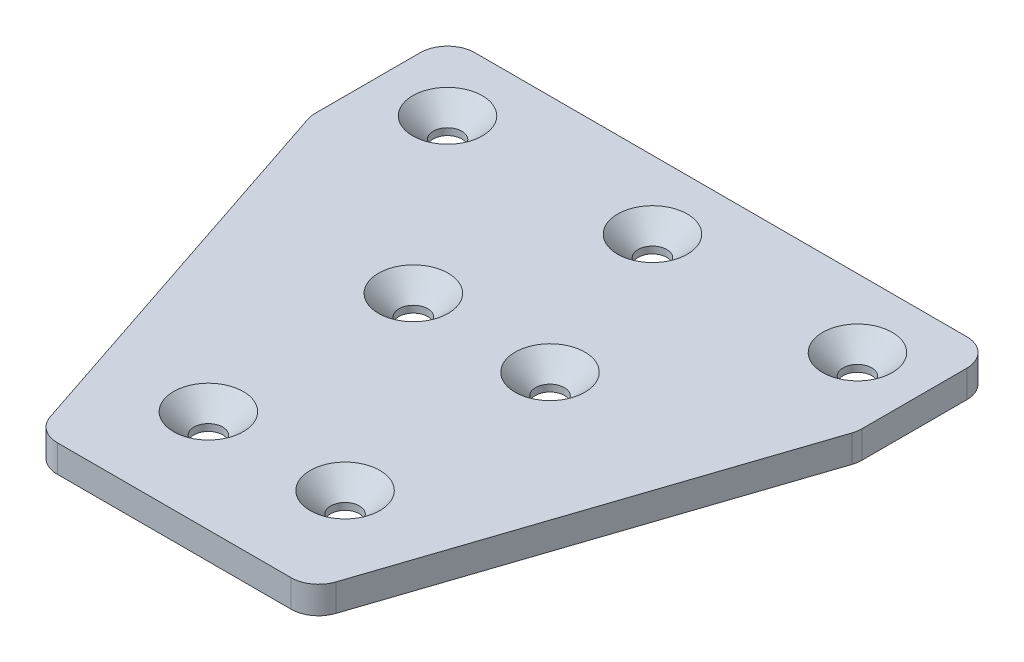
ISO-10303-21;
HEADER;
FILE_DESCRIPTION(('STEP AP214'),'2;1');
FILE_NAME('part.step','',(''),(''),'','','');
FILE_SCHEMA(('AUTOMOTIVE_DESIGN { 1 0 10303 214 1 1 1 1 }'));
ENDSEC;
DATA;
#1=APPLICATION_CONTEXT('core data for automotive mechanical design processes');
#2=APPLICATION_PROTOCOL_DEFINITION('international standard','automotive_design',2000,#1);
#3=PRODUCT_CONTEXT('',#1,'mechanical');
#4=PRODUCT('Part','Part','',(#3));
#5=PRODUCT_RELATED_PRODUCT_CATEGORY('part','',(#4));
#6=PRODUCT_DEFINITION_FORMATION('','',#4);
#7=PRODUCT_DEFINITION_CONTEXT('part definition',#1,'design');
#8=PRODUCT_DEFINITION('design','',#6,#7);
#9=PRODUCT_DEFINITION_SHAPE('','',#8);
#10=(LENGTH_UNIT() NAMED_UNIT(*) SI_UNIT(.MILLI.,.METRE.));
#11=(NAMED_UNIT(*) PLANE_ANGLE_UNIT() SI_UNIT($,.RADIAN.));
#12=(NAMED_UNIT(*) SI_UNIT($,.STERADIAN.) SOLID_ANGLE_UNIT());
#13=UNCERTAINTY_MEASURE_WITH_UNIT(LENGTH_MEASURE(1.E-05),#10,'distance_accuracy_value','');
#14=(GEOMETRIC_REPRESENTATION_CONTEXT(3) GLOBAL_UNCERTAINTY_ASSIGNED_CONTEXT((#13)) GLOBAL_UNIT_ASSIGNED_CONTEXT((#10,
#11,#12)) REPRESENTATION_CONTEXT('',''));
#15=CARTESIAN_POINT('',(0.,0.,0.));
#16=DIRECTION('',(0.,0.,1.));
#17=DIRECTION('',(1.,0.,0.));
#18=AXIS2_PLACEMENT_3D('',#15,#16,#17);
#19=CARTESIAN_POINT('',(39.,4.,13.));
#20=DIRECTION('',(-0.948683298050514,0.,-0.316227766016838));
#21=DIRECTION('',(-0.316227766016838,0.,0.948683298050514));
#22=AXIS2_PLACEMENT_3D('',#19,#20,#21);
#23=PLANE('',#22);
#24=DIRECTION('',(0.316227766016838,0.,-0.948683298050514));
#25=VECTOR('',#24,1.);
#26=CARTESIAN_POINT('',(39.,0.,13.));
#27=LINE('',#26,#25);
#28=CARTESIAN_POINT('',(20.9116963119776,0.,67.2649110640673));
#29=VERTEX_POINT('',#28);
#30=CARTESIAN_POINT('',(39.7947331922021,0.,10.6158004233938));
#31=VERTEX_POINT('',#30);
#32=EDGE_CURVE('E327',#29,#31,#27,.T.);
#33=ORIENTED_EDGE('',*,*,#32,.T.);
#34=DIRECTION('',(0.,-1.,0.));
#35=VECTOR('',#34,1.);
#36=CARTESIAN_POINT('',(39.7947331922021,4.,10.6158004233938));
#37=LINE('',#36,#35);
#38=CARTESIAN_POINT('',(39.7947331922021,4.,10.6158004233938));
#39=VERTEX_POINT('',#38);
#40=EDGE_CURVE('E318',#31,#39,#37,.F.);
#41=ORIENTED_EDGE('',*,*,#40,.T.);
#42=DIRECTION('',(0.316227766016838,0.,-0.948683298050514));
#43=VECTOR('',#42,1.);
#44=CARTESIAN_POINT('',(39.,4.,13.));
#45=LINE('',#44,#43);
#46=CARTESIAN_POINT('',(20.9116963119776,4.,67.2649110640673));
#47=VERTEX_POINT('',#46);
#48=EDGE_CURVE('E205',#47,#39,#45,.T.);
#49=ORIENTED_EDGE('',*,*,#48,.F.);
#50=DIRECTION('',(0.,-1.,0.));
#51=VECTOR('',#50,1.);
#52=CARTESIAN_POINT('',(20.9116963119776,4.,67.2649110640673));
#53=LINE('',#52,#51);
#54=EDGE_CURVE('E314',#47,#29,#53,.T.);
#55=ORIENTED_EDGE('',*,*,#54,.T.);
#56=EDGE_LOOP('',(#33,#41,#49,#55));
#57=FACE_BOUND('',#56,.T.);
#58=ADVANCED_FACE('F48',(#57),#23,.F.);
#59=CARTESIAN_POINT('',(40.,4.,0.));
#60=DIRECTION('',(-1.,0.,0.));
#61=DIRECTION('',(0.,0.,1.));
#62=AXIS2_PLACEMENT_3D('',#59,#60,#61);
#63=PLANE('',#62);
#64=DIRECTION('',(0.,0.,-1.));
#65=VECTOR('',#64,1.);
#66=CARTESIAN_POINT('',(40.,0.,0.));
#67=LINE('',#66,#65);
#68=CARTESIAN_POINT('',(40.,0.,9.35088935932646));
#69=VERTEX_POINT('',#68);
#70=CARTESIAN_POINT('',(40.,0.,-6.));
#71=VERTEX_POINT('',#70);
#72=EDGE_CURVE('E358',#69,#71,#67,.T.);
#73=ORIENTED_EDGE('',*,*,#72,.T.);
#74=DIRECTION('',(0.,-1.,0.));
#75=VECTOR('',#74,1.);
#76=CARTESIAN_POINT('',(40.,4.,-6.));
#77=LINE('',#76,#75);
#78=CARTESIAN_POINT('',(40.,4.,-6.));
#79=VERTEX_POINT('',#78);
#80=EDGE_CURVE('E311',#71,#79,#77,.F.);
#81=ORIENTED_EDGE('',*,*,#80,.T.);
#82=DIRECTION('',(0.,0.,-1.));
#83=VECTOR('',#82,1.);
#84=CARTESIAN_POINT('',(40.,4.,0.));
#85=LINE('',#84,#83);
#86=CARTESIAN_POINT('',(40.,4.,9.35088935932646));
#87=VERTEX_POINT('',#86);
#88=EDGE_CURVE('E338',#87,#79,#85,.T.);
#89=ORIENTED_EDGE('',*,*,#88,.F.);
#90=DIRECTION('',(0.,-1.,0.));
#91=VECTOR('',#90,1.);
#92=CARTESIAN_POINT('',(40.,4.,9.35088935932646));
#93=LINE('',#92,#91);
#94=EDGE_CURVE('E307',#87,#69,#93,.T.);
#95=ORIENTED_EDGE('',*,*,#94,.T.);
#96=EDGE_LOOP('',(#73,#81,#89,#95));
#97=FACE_BOUND('',#96,.T.);
#98=ADVANCED_FACE('F386',(#97),#63,.F.);
#99=CARTESIAN_POINT('',(0.,4.,-10.));
#100=DIRECTION('',(0.,0.,-1.));
#101=DIRECTION('',(-1.,0.,0.));
#102=AXIS2_PLACEMENT_3D('',#99,#100,#101);
#103=PLANE('',#102);
#104=DIRECTION('',(1.,0.,0.));
#105=VECTOR('',#104,1.);
#106=CARTESIAN_POINT('',(0.,0.,-10.));
#107=LINE('',#106,#105);
#108=CARTESIAN_POINT('',(-36.,0.,-10.));
#109=VERTEX_POINT('',#108);
#110=CARTESIAN_POINT('',(36.,0.,-10.));
#111=VERTEX_POINT('',#110);
#112=EDGE_CURVE('E174',#109,#111,#107,.T.);
#113=ORIENTED_EDGE('',*,*,#112,.F.);
#114=DIRECTION('',(0.,-1.,0.));
#115=VECTOR('',#114,1.);
#116=CARTESIAN_POINT('',(-36.,4.,-10.));
#117=LINE('',#116,#115);
#118=CARTESIAN_POINT('',(-36.,4.,-10.));
#119=VERTEX_POINT('',#118);
#120=EDGE_CURVE('E304',#109,#119,#117,.F.);
#121=ORIENTED_EDGE('',*,*,#120,.T.);
#122=DIRECTION('',(1.,0.,0.));
#123=VECTOR('',#122,1.);
#124=CARTESIAN_POINT('',(0.,4.,-10.));
#125=LINE('',#124,#123);
#126=CARTESIAN_POINT('',(36.,4.,-10.));
#127=VERTEX_POINT('',#126);
#128=EDGE_CURVE('E342',#119,#127,#125,.T.);
#129=ORIENTED_EDGE('',*,*,#128,.T.);
#130=DIRECTION('',(0.,-1.,0.));
#131=VECTOR('',#130,1.);
#132=CARTESIAN_POINT('',(36.,0.,-10.));
#133=LINE('',#132,#131);
#134=EDGE_CURVE('E300',#127,#111,#133,.T.);
#135=ORIENTED_EDGE('',*,*,#134,.T.);
#136=EDGE_LOOP('',(#113,#121,#129,#135));
#137=FACE_BOUND('',#136,.T.);
#138=ADVANCED_FACE('F367',(#137),#103,.T.);
#139=CARTESIAN_POINT('',(-40.,4.,0.));
#140=DIRECTION('',(-1.,0.,0.));
#141=DIRECTION('',(0.,0.,1.));
#142=AXIS2_PLACEMENT_3D('',#139,#140,#141);
#143=PLANE('',#142);
#144=DIRECTION('',(0.,0.,-1.));
#145=VECTOR('',#144,1.);
#146=CARTESIAN_POINT('',(-40.,0.,0.));
#147=LINE('',#146,#145);
#148=CARTESIAN_POINT('',(-40.,0.,9.35088935932649));
#149=VERTEX_POINT('',#148);
#150=CARTESIAN_POINT('',(-40.,0.,-6.));
#151=VERTEX_POINT('',#150);
#152=EDGE_CURVE('E168',#149,#151,#147,.T.);
#153=ORIENTED_EDGE('',*,*,#152,.F.);
#154=DIRECTION('',(0.,-1.,0.));
#155=VECTOR('',#154,1.);
#156=CARTESIAN_POINT('',(-40.,4.,9.35088935932649));
#157=LINE('',#156,#155);
#158=CARTESIAN_POINT('',(-40.,4.,9.35088935932649));
#159=VERTEX_POINT('',#158);
#160=EDGE_CURVE('E143',#149,#159,#157,.F.);
#161=ORIENTED_EDGE('',*,*,#160,.T.);
#162=DIRECTION('',(0.,0.,-1.));
#163=VECTOR('',#162,1.);
#164=CARTESIAN_POINT('',(-40.,4.,0.));
#165=LINE('',#164,#163);
#166=CARTESIAN_POINT('',(-40.,4.,-6.));
#167=VERTEX_POINT('',#166);
#168=EDGE_CURVE('E348',#159,#167,#165,.T.);
#169=ORIENTED_EDGE('',*,*,#168,.T.);
#170=DIRECTION('',(0.,-1.,0.));
#171=VECTOR('',#170,1.);
#172=CARTESIAN_POINT('',(-40.,4.,-6.));
#173=LINE('',#172,#171);
#174=EDGE_CURVE('E149',#167,#151,#173,.T.);
#175=ORIENTED_EDGE('',*,*,#174,.T.);
#176=EDGE_LOOP('',(#153,#161,#169,#175));
#177=FACE_BOUND('',#176,.T.);
#178=ADVANCED_FACE('F377',(#177),#143,.T.);
#179=CARTESIAN_POINT('',(-39.,4.,13.));
#180=DIRECTION('',(0.948683298050514,0.,-0.316227766016838));
#181=DIRECTION('',(-0.316227766016838,0.,-0.948683298050514));
#182=AXIS2_PLACEMENT_3D('',#179,#180,#181);
#183=PLANE('',#182);
#184=DIRECTION('',(0.316227766016838,0.,0.948683298050514));
#185=VECTOR('',#184,1.);
#186=CARTESIAN_POINT('',(-39.,4.,13.));
#187=LINE('',#186,#185);
#188=CARTESIAN_POINT('',(-39.7947331922021,4.,10.6158004233938));
#189=VERTEX_POINT('',#188);
#190=CARTESIAN_POINT('',(-20.9116963119775,4.,67.2649110640674));
#191=VERTEX_POINT('',#190);
#192=EDGE_CURVE('E158',#189,#191,#187,.T.);
#193=ORIENTED_EDGE('',*,*,#192,.F.);
#194=DIRECTION('',(0.,-1.,0.));
#195=VECTOR('',#194,1.);
#196=CARTESIAN_POINT('',(-39.7947331922021,0.,10.6158004233938));
#197=LINE('',#196,#195);
#198=CARTESIAN_POINT('',(-39.7947331922021,0.,10.6158004233938));
#199=VERTEX_POINT('',#198);
#200=EDGE_CURVE('E142',#189,#199,#197,.T.);
#201=ORIENTED_EDGE('',*,*,#200,.T.);
#202=DIRECTION('',(0.316227766016838,0.,0.948683298050514));
#203=VECTOR('',#202,1.);
#204=CARTESIAN_POINT('',(-39.,0.,13.));
#205=LINE('',#204,#203);
#206=CARTESIAN_POINT('',(-20.9116963119775,0.,67.2649110640674));
#207=VERTEX_POINT('',#206);
#208=EDGE_CURVE('E156',#199,#207,#205,.T.);
#209=ORIENTED_EDGE('',*,*,#208,.T.);
#210=DIRECTION('',(0.,-1.,0.));
#211=VECTOR('',#210,1.);
#212=CARTESIAN_POINT('',(-20.9116963119775,4.,67.2649110640674));
#213=LINE('',#212,#211);
#214=EDGE_CURVE('E161',#207,#191,#213,.F.);
#215=ORIENTED_EDGE('',*,*,#214,.T.);
#216=EDGE_LOOP('',(#193,#201,#209,#215));
#217=FACE_BOUND('',#216,.T.);
#218=ADVANCED_FACE('F155',(#217),#183,.F.);
#219=CARTESIAN_POINT('',(30.,4.,0.));
#220=DIRECTION('',(0.,-1.,0.));
#221=DIRECTION('',(0.,0.,-1.));
#222=AXIS2_PLACEMENT_3D('',#219,#220,#221);
#223=CYLINDRICAL_SURFACE('',#222,2.1);
#224=CARTESIAN_POINT('',(30.,0.999999999999983,0.));
#225=DIRECTION('',(0.,1.,0.));
#226=DIRECTION('',(0.,0.,1.));
#227=AXIS2_PLACEMENT_3D('',#224,#225,#226);
#228=CIRCLE('',#227,2.1);
#229=CARTESIAN_POINT('',(30.,0.999999999999983,2.1));
#230=VERTEX_POINT('',#229);
#231=EDGE_CURVE('E251',#230,#230,#228,.T.);
#232=ORIENTED_EDGE('',*,*,#231,.T.);
#233=EDGE_LOOP('',(#232));
#234=FACE_BOUND('',#233,.T.);
#235=CARTESIAN_POINT('',(30.,0.,0.));
#236=DIRECTION('',(0.,1.,0.));
#237=DIRECTION('',(0.,0.,1.));
#238=AXIS2_PLACEMENT_3D('',#235,#236,#237);
#239=CIRCLE('',#238,2.1);
#240=CARTESIAN_POINT('',(30.,0.,2.1));
#241=VERTEX_POINT('',#240);
#242=EDGE_CURVE('E197',#241,#241,#239,.T.);
#243=ORIENTED_EDGE('',*,*,#242,.F.);
#244=EDGE_LOOP('',(#243));
#245=FACE_BOUND('',#244,.T.);
#246=ADVANCED_FACE('F384',(#234,#245),#223,.F.);
#247=CARTESIAN_POINT('',(0.,4.,0.));
#248=DIRECTION('',(0.,-1.,0.));
#249=DIRECTION('',(0.,0.,-1.));
#250=AXIS2_PLACEMENT_3D('',#247,#248,#249);
#251=CYLINDRICAL_SURFACE('',#250,2.1);
#252=CARTESIAN_POINT('',(0.,0.999999999999986,0.));
#253=DIRECTION('',(0.,1.,0.));
#254=DIRECTION('',(0.,0.,1.));
#255=AXIS2_PLACEMENT_3D('',#252,#253,#254);
#256=CIRCLE('',#255,2.1);
#257=CARTESIAN_POINT('',(0.,0.999999999999986,2.1));
#258=VERTEX_POINT('',#257);
#259=EDGE_CURVE('E255',#258,#258,#256,.T.);
#260=ORIENTED_EDGE('',*,*,#259,.T.);
#261=EDGE_LOOP('',(#260));
#262=FACE_BOUND('',#261,.T.);
#263=CARTESIAN_POINT('',(0.,0.,0.));
#264=DIRECTION('',(0.,1.,0.));
#265=DIRECTION('',(0.,0.,1.));
#266=AXIS2_PLACEMENT_3D('',#263,#264,#265);
#267=CIRCLE('',#266,2.1);
#268=CARTESIAN_POINT('',(0.,0.,2.1));
#269=VERTEX_POINT('',#268);
#270=EDGE_CURVE('E193',#269,#269,#267,.T.);
#271=ORIENTED_EDGE('',*,*,#270,.F.);
#272=EDGE_LOOP('',(#271));
#273=FACE_BOUND('',#272,.T.);
#274=ADVANCED_FACE('F540',(#262,#273),#251,.F.);
#275=CARTESIAN_POINT('',(-9.99999999999999,4.,25.));
#276=DIRECTION('',(0.,-1.,0.));
#277=DIRECTION('',(0.,0.,-1.));
#278=AXIS2_PLACEMENT_3D('',#275,#276,#277);
#279=CYLINDRICAL_SURFACE('',#278,2.1);
#280=CARTESIAN_POINT('',(-9.99999999999999,0.999999999999985,25.));
#281=DIRECTION('',(0.,1.,0.));
#282=DIRECTION('',(0.,0.,1.));
#283=AXIS2_PLACEMENT_3D('',#280,#281,#282);
#284=CIRCLE('',#283,2.1);
#285=CARTESIAN_POINT('',(-9.99999999999999,0.999999999999985,27.1));
#286=VERTEX_POINT('',#285);
#287=EDGE_CURVE('E247',#286,#286,#284,.T.);
#288=ORIENTED_EDGE('',*,*,#287,.T.);
#289=EDGE_LOOP('',(#288));
#290=FACE_BOUND('',#289,.T.);
#291=CARTESIAN_POINT('',(-9.99999999999999,0.,25.));
#292=DIRECTION('',(0.,1.,0.));
#293=DIRECTION('',(0.,0.,1.));
#294=AXIS2_PLACEMENT_3D('',#291,#292,#293);
#295=CIRCLE('',#294,2.1);
#296=CARTESIAN_POINT('',(-9.99999999999999,0.,27.1));
#297=VERTEX_POINT('',#296);
#298=EDGE_CURVE('E189',#297,#297,#295,.T.);
#299=ORIENTED_EDGE('',*,*,#298,.F.);
#300=EDGE_LOOP('',(#299));
#301=FACE_BOUND('',#300,.T.);
#302=ADVANCED_FACE('F547',(#290,#301),#279,.F.);
#303=CARTESIAN_POINT('',(10.,4.,25.));
#304=DIRECTION('',(0.,-1.,0.));
#305=DIRECTION('',(0.,0.,-1.));
#306=AXIS2_PLACEMENT_3D('',#303,#304,#305);
#307=CYLINDRICAL_SURFACE('',#306,2.1);
#308=CARTESIAN_POINT('',(10.,0.999999999999985,25.));
#309=DIRECTION('',(0.,1.,0.));
#310=DIRECTION('',(0.,0.,1.));
#311=AXIS2_PLACEMENT_3D('',#308,#309,#310);
#312=CIRCLE('',#311,2.1);
#313=CARTESIAN_POINT('',(10.,0.999999999999985,27.1));
#314=VERTEX_POINT('',#313);
#315=EDGE_CURVE('E243',#314,#314,#312,.T.);
#316=ORIENTED_EDGE('',*,*,#315,.T.);
#317=EDGE_LOOP('',(#316));
#318=FACE_BOUND('',#317,.T.);
#319=CARTESIAN_POINT('',(10.,0.,25.));
#320=DIRECTION('',(0.,1.,0.));
#321=DIRECTION('',(0.,0.,1.));
#322=AXIS2_PLACEMENT_3D('',#319,#320,#321);
#323=CIRCLE('',#322,2.1);
#324=CARTESIAN_POINT('',(10.,0.,27.1));
#325=VERTEX_POINT('',#324);
#326=EDGE_CURVE('E185',#325,#325,#323,.T.);
#327=ORIENTED_EDGE('',*,*,#326,.F.);
#328=EDGE_LOOP('',(#327));
#329=FACE_BOUND('',#328,.T.);
#330=ADVANCED_FACE('F555',(#318,#329),#307,.F.);
#331=CARTESIAN_POINT('',(10.,4.,55.));
#332=DIRECTION('',(0.,-1.,0.));
#333=DIRECTION('',(0.,0.,-1.));
#334=AXIS2_PLACEMENT_3D('',#331,#332,#333);
#335=CYLINDRICAL_SURFACE('',#334,2.1);
#336=CARTESIAN_POINT('',(10.,0.999999999999983,55.));
#337=DIRECTION('',(0.,1.,0.));
#338=DIRECTION('',(0.,0.,1.));
#339=AXIS2_PLACEMENT_3D('',#336,#337,#338);
#340=CIRCLE('',#339,2.1);
#341=CARTESIAN_POINT('',(10.,0.999999999999983,57.1));
#342=VERTEX_POINT('',#341);
#343=EDGE_CURVE('E206',#342,#342,#340,.T.);
#344=ORIENTED_EDGE('',*,*,#343,.T.);
#345=EDGE_LOOP('',(#344));
#346=FACE_BOUND('',#345,.T.);
#347=CARTESIAN_POINT('',(10.,0.,55.));
#348=DIRECTION('',(0.,1.,0.));
#349=DIRECTION('',(0.,0.,1.));
#350=AXIS2_PLACEMENT_3D('',#347,#348,#349);
#351=CIRCLE('',#350,2.1);
#352=CARTESIAN_POINT('',(10.,0.,57.1));
#353=VERTEX_POINT('',#352);
#354=EDGE_CURVE('E181',#353,#353,#351,.T.);
#355=ORIENTED_EDGE('',*,*,#354,.F.);
#356=EDGE_LOOP('',(#355));
#357=FACE_BOUND('',#356,.T.);
#358=ADVANCED_FACE('F563',(#346,#357),#335,.F.);
#359=CARTESIAN_POINT('',(-9.99999999999999,4.,55.));
#360=DIRECTION('',(0.,-1.,0.));
#361=DIRECTION('',(0.,0.,-1.));
#362=AXIS2_PLACEMENT_3D('',#359,#360,#361);
#363=CYLINDRICAL_SURFACE('',#362,2.1);
#364=CARTESIAN_POINT('',(-9.99999999999999,0.999999999999985,55.));
#365=DIRECTION('',(0.,1.,0.));
#366=DIRECTION('',(0.,0.,1.));
#367=AXIS2_PLACEMENT_3D('',#364,#365,#366);
#368=CIRCLE('',#367,2.1);
#369=CARTESIAN_POINT('',(-9.99999999999999,0.999999999999985,57.1));
#370=VERTEX_POINT('',#369);
#371=EDGE_CURVE('E239',#370,#370,#368,.T.);
#372=ORIENTED_EDGE('',*,*,#371,.T.);
#373=EDGE_LOOP('',(#372));
#374=FACE_BOUND('',#373,.T.);
#375=CARTESIAN_POINT('',(-9.99999999999999,0.,55.));
#376=DIRECTION('',(0.,1.,0.));
#377=DIRECTION('',(0.,0.,1.));
#378=AXIS2_PLACEMENT_3D('',#375,#376,#377);
#379=CIRCLE('',#378,2.1);
#380=CARTESIAN_POINT('',(-9.99999999999999,0.,57.1));
#381=VERTEX_POINT('',#380);
#382=EDGE_CURVE('E172',#381,#381,#379,.T.);
#383=ORIENTED_EDGE('',*,*,#382,.F.);
#384=EDGE_LOOP('',(#383));
#385=FACE_BOUND('',#384,.T.);
#386=ADVANCED_FACE('F520',(#374,#385),#363,.F.);
#387=CARTESIAN_POINT('',(0.,4.,70.));
#388=DIRECTION('',(0.,0.,-1.));
#389=DIRECTION('',(-1.,0.,0.));
#390=AXIS2_PLACEMENT_3D('',#387,#388,#389);
#391=PLANE('',#390);
#392=DIRECTION('',(1.,0.,0.));
#393=VECTOR('',#392,1.);
#394=CARTESIAN_POINT('',(0.,0.,70.));
#395=LINE('',#394,#393);
#396=CARTESIAN_POINT('',(-17.1169631197755,0.,70.));
#397=VERTEX_POINT('',#396);
#398=CARTESIAN_POINT('',(17.1169631197755,0.,70.));
#399=VERTEX_POINT('',#398);
#400=EDGE_CURVE('E167',#397,#399,#395,.T.);
#401=ORIENTED_EDGE('',*,*,#400,.T.);
#402=DIRECTION('',(0.,-1.,0.));
#403=VECTOR('',#402,1.);
#404=CARTESIAN_POINT('',(17.1169631197755,4.,70.));
#405=LINE('',#404,#403);
#406=CARTESIAN_POINT('',(17.1169631197755,4.,70.));
#407=VERTEX_POINT('',#406);
#408=EDGE_CURVE('E11',#399,#407,#405,.F.);
#409=ORIENTED_EDGE('',*,*,#408,.T.);
#410=DIRECTION('',(1.,0.,0.));
#411=VECTOR('',#410,1.);
#412=CARTESIAN_POINT('',(0.,4.,70.));
#413=LINE('',#412,#411);
#414=CARTESIAN_POINT('',(-17.1169631197755,4.,70.));
#415=VERTEX_POINT('',#414);
#416=EDGE_CURVE('E211',#415,#407,#413,.T.);
#417=ORIENTED_EDGE('',*,*,#416,.F.);
#418=DIRECTION('',(0.,-1.,0.));
#419=VECTOR('',#418,1.);
#420=CARTESIAN_POINT('',(-17.1169631197755,4.,70.));
#421=LINE('',#420,#419);
#422=EDGE_CURVE('E57',#415,#397,#421,.T.);
#423=ORIENTED_EDGE('',*,*,#422,.T.);
#424=EDGE_LOOP('',(#401,#409,#417,#423));
#425=FACE_BOUND('',#424,.T.);
#426=ADVANCED_FACE('F323',(#425),#391,.F.);
#427=CARTESIAN_POINT('',(-30.,4.,0.));
#428=DIRECTION('',(0.,-1.,0.));
#429=DIRECTION('',(0.,0.,-1.));
#430=AXIS2_PLACEMENT_3D('',#427,#428,#429);
#431=CYLINDRICAL_SURFACE('',#430,2.1);
#432=CARTESIAN_POINT('',(-30.,0.999999999999986,0.));
#433=DIRECTION('',(0.,1.,0.));
#434=DIRECTION('',(0.,0.,1.));
#435=AXIS2_PLACEMENT_3D('',#432,#433,#434);
#436=CIRCLE('',#435,2.1);
#437=CARTESIAN_POINT('',(-30.,0.999999999999986,2.1));
#438=VERTEX_POINT('',#437);
#439=EDGE_CURVE('E259',#438,#438,#436,.T.);
#440=ORIENTED_EDGE('',*,*,#439,.T.);
#441=EDGE_LOOP('',(#440));
#442=FACE_BOUND('',#441,.T.);
#443=CARTESIAN_POINT('',(-30.,0.,0.));
#444=DIRECTION('',(0.,1.,0.));
#445=DIRECTION('',(0.,0.,1.));
#446=AXIS2_PLACEMENT_3D('',#443,#444,#445);
#447=CIRCLE('',#446,2.1);
#448=CARTESIAN_POINT('',(-30.,0.,2.1));
#449=VERTEX_POINT('',#448);
#450=EDGE_CURVE('E201',#449,#449,#447,.T.);
#451=ORIENTED_EDGE('',*,*,#450,.F.);
#452=EDGE_LOOP('',(#451));
#453=FACE_BOUND('',#452,.T.);
#454=ADVANCED_FACE('F512',(#442,#453),#431,.F.);
#455=CARTESIAN_POINT('',(0.,4.,0.));
#456=DIRECTION('',(0.,1.,0.));
#457=DIRECTION('',(0.,0.,1.));
#458=AXIS2_PLACEMENT_3D('',#455,#456,#457);
#459=PLANE('',#458);
#460=CARTESIAN_POINT('',(10.,4.,55.));
#461=DIRECTION('',(0.,1.,0.));
#462=DIRECTION('',(0.,0.,1.));
#463=AXIS2_PLACEMENT_3D('',#460,#461,#462);
#464=CIRCLE('',#463,5.10000000000002);
#465=CARTESIAN_POINT('',(10.,4.,60.1));
#466=VERTEX_POINT('',#465);
#467=EDGE_CURVE('E235',#466,#466,#464,.F.);
#468=ORIENTED_EDGE('',*,*,#467,.T.);
#469=EDGE_LOOP('',(#468));
#470=FACE_BOUND('',#469,.T.);
#471=CARTESIAN_POINT('',(-9.99999999999999,4.,55.));
#472=DIRECTION('',(0.,1.,0.));
#473=DIRECTION('',(0.,0.,1.));
#474=AXIS2_PLACEMENT_3D('',#471,#472,#473);
#475=CIRCLE('',#474,5.10000000000002);
#476=CARTESIAN_POINT('',(-9.99999999999999,4.,60.1));
#477=VERTEX_POINT('',#476);
#478=EDGE_CURVE('E231',#477,#477,#475,.F.);
#479=ORIENTED_EDGE('',*,*,#478,.T.);
#480=EDGE_LOOP('',(#479));
#481=FACE_BOUND('',#480,.T.);
#482=CARTESIAN_POINT('',(10.,4.,25.));
#483=DIRECTION('',(0.,1.,0.));
#484=DIRECTION('',(0.,0.,1.));
#485=AXIS2_PLACEMENT_3D('',#482,#483,#484);
#486=CIRCLE('',#485,5.10000000000002);
#487=CARTESIAN_POINT('',(10.,4.,30.1));
#488=VERTEX_POINT('',#487);
#489=EDGE_CURVE('E227',#488,#488,#486,.F.);
#490=ORIENTED_EDGE('',*,*,#489,.T.);
#491=EDGE_LOOP('',(#490));
#492=FACE_BOUND('',#491,.T.);
#493=CARTESIAN_POINT('',(-9.99999999999999,4.,25.));
#494=DIRECTION('',(0.,1.,0.));
#495=DIRECTION('',(0.,0.,1.));
#496=AXIS2_PLACEMENT_3D('',#493,#494,#495);
#497=CIRCLE('',#496,5.10000000000002);
#498=CARTESIAN_POINT('',(-9.99999999999999,4.,30.1));
#499=VERTEX_POINT('',#498);
#500=EDGE_CURVE('E223',#499,#499,#497,.F.);
#501=ORIENTED_EDGE('',*,*,#500,.T.);
#502=EDGE_LOOP('',(#501));
#503=FACE_BOUND('',#502,.T.);
#504=CARTESIAN_POINT('',(30.,4.,0.));
#505=DIRECTION('',(0.,1.,0.));
#506=DIRECTION('',(0.,0.,1.));
#507=AXIS2_PLACEMENT_3D('',#504,#505,#506);
#508=CIRCLE('',#507,5.10000000000002);
#509=CARTESIAN_POINT('',(30.,4.,5.10000000000003));
#510=VERTEX_POINT('',#509);
#511=EDGE_CURVE('E219',#510,#510,#508,.F.);
#512=ORIENTED_EDGE('',*,*,#511,.T.);
#513=EDGE_LOOP('',(#512));
#514=FACE_BOUND('',#513,.T.);
#515=CARTESIAN_POINT('',(0.,4.,0.));
#516=DIRECTION('',(0.,1.,0.));
#517=DIRECTION('',(0.,0.,1.));
#518=AXIS2_PLACEMENT_3D('',#515,#516,#517);
#519=CIRCLE('',#518,5.10000000000002);
#520=CARTESIAN_POINT('',(0.,4.,5.10000000000002));
#521=VERTEX_POINT('',#520);
#522=EDGE_CURVE('E215',#521,#521,#519,.F.);
#523=ORIENTED_EDGE('',*,*,#522,.T.);
#524=EDGE_LOOP('',(#523));
#525=FACE_BOUND('',#524,.T.);
#526=CARTESIAN_POINT('',(-30.,4.,0.));
#527=DIRECTION('',(0.,1.,0.));
#528=DIRECTION('',(0.,0.,1.));
#529=AXIS2_PLACEMENT_3D('',#526,#527,#528);
#530=CIRCLE('',#529,5.10000000000002);
#531=CARTESIAN_POINT('',(-30.,4.,5.10000000000002));
#532=VERTEX_POINT('',#531);
#533=EDGE_CURVE('E210',#532,#532,#530,.F.);
#534=ORIENTED_EDGE('',*,*,#533,.T.);
#535=EDGE_LOOP('',(#534));
#536=FACE_BOUND('',#535,.T.);
#537=ORIENTED_EDGE('',*,*,#168,.F.);
#538=CARTESIAN_POINT('',(-36.,4.,9.35088935932649));
#539=DIRECTION('',(0.,1.,0.));
#540=DIRECTION('',(0.,0.,1.));
#541=AXIS2_PLACEMENT_3D('',#538,#539,#540);
#542=CIRCLE('',#541,4.);
#543=EDGE_CURVE('E297',#159,#189,#542,.T.);
#544=ORIENTED_EDGE('',*,*,#543,.T.);
#545=ORIENTED_EDGE('',*,*,#192,.T.);
#546=CARTESIAN_POINT('',(-17.1169631197755,4.,66.));
#547=DIRECTION('',(0.,1.,0.));
#548=DIRECTION('',(0.,0.,1.));
#549=AXIS2_PLACEMENT_3D('',#546,#547,#548);
#550=CIRCLE('',#549,4.);
#551=EDGE_CURVE('E69',#191,#415,#550,.T.);
#552=ORIENTED_EDGE('',*,*,#551,.T.);
#553=ORIENTED_EDGE('',*,*,#416,.T.);
#554=CARTESIAN_POINT('',(17.1169631197755,4.,66.));
#555=DIRECTION('',(0.,1.,0.));
#556=DIRECTION('',(0.,0.,1.));
#557=AXIS2_PLACEMENT_3D('',#554,#555,#556);
#558=CIRCLE('',#557,4.);
#559=EDGE_CURVE('E285',#407,#47,#558,.T.);
#560=ORIENTED_EDGE('',*,*,#559,.T.);
#561=ORIENTED_EDGE('',*,*,#48,.T.);
#562=CARTESIAN_POINT('',(36.,4.,9.35088935932646));
#563=DIRECTION('',(0.,1.,0.));
#564=DIRECTION('',(0.,0.,1.));
#565=AXIS2_PLACEMENT_3D('',#562,#563,#564);
#566=CIRCLE('',#565,4.);
#567=EDGE_CURVE('E288',#39,#87,#566,.T.);
#568=ORIENTED_EDGE('',*,*,#567,.T.);
#569=ORIENTED_EDGE('',*,*,#88,.T.);
#570=CARTESIAN_POINT('',(36.,4.,-6.));
#571=DIRECTION('',(0.,1.,0.));
#572=DIRECTION('',(0.,0.,1.));
#573=AXIS2_PLACEMENT_3D('',#570,#571,#572);
#574=CIRCLE('',#573,4.);
#575=EDGE_CURVE('E291',#79,#127,#574,.T.);
#576=ORIENTED_EDGE('',*,*,#575,.T.);
#577=ORIENTED_EDGE('',*,*,#128,.F.);
#578=CARTESIAN_POINT('',(-36.,4.,-6.));
#579=DIRECTION('',(0.,1.,0.));
#580=DIRECTION('',(0.,0.,1.));
#581=AXIS2_PLACEMENT_3D('',#578,#579,#580);
#582=CIRCLE('',#581,4.);
#583=EDGE_CURVE('E294',#119,#167,#582,.T.);
#584=ORIENTED_EDGE('',*,*,#583,.T.);
#585=EDGE_LOOP('',(#537,#544,#545,#552,#553,#560,#561,#568,#569,#576,#577,#584));
#586=FACE_BOUND('',#585,.T.);
#587=ADVANCED_FACE('F375',(#470,#481,#492,#503,#514,#525,#536,#586),#459,.T.);
#588=CARTESIAN_POINT('',(0.,0.,0.));
#589=DIRECTION('',(0.,1.,0.));
#590=DIRECTION('',(0.,0.,1.));
#591=AXIS2_PLACEMENT_3D('',#588,#589,#590);
#592=PLANE('',#591);
#593=ORIENTED_EDGE('',*,*,#208,.F.);
#594=CARTESIAN_POINT('',(-36.,0.,9.35088935932649));
#595=DIRECTION('',(0.,1.,0.));
#596=DIRECTION('',(0.,0.,1.));
#597=AXIS2_PLACEMENT_3D('',#594,#595,#596);
#598=CIRCLE('',#597,4.);
#599=EDGE_CURVE('E138',#199,#149,#598,.F.);
#600=ORIENTED_EDGE('',*,*,#599,.T.);
#601=ORIENTED_EDGE('',*,*,#152,.T.);
#602=CARTESIAN_POINT('',(-36.,0.,-6.));
#603=DIRECTION('',(0.,1.,0.));
#604=DIRECTION('',(0.,0.,1.));
#605=AXIS2_PLACEMENT_3D('',#602,#603,#604);
#606=CIRCLE('',#605,4.);
#607=EDGE_CURVE('E150',#151,#109,#606,.F.);
#608=ORIENTED_EDGE('',*,*,#607,.T.);
#609=ORIENTED_EDGE('',*,*,#112,.T.);
#610=CARTESIAN_POINT('',(36.,0.,-6.));
#611=DIRECTION('',(0.,1.,0.));
#612=DIRECTION('',(0.,0.,1.));
#613=AXIS2_PLACEMENT_3D('',#610,#611,#612);
#614=CIRCLE('',#613,4.);
#615=EDGE_CURVE('E273',#111,#71,#614,.F.);
#616=ORIENTED_EDGE('',*,*,#615,.T.);
#617=ORIENTED_EDGE('',*,*,#72,.F.);
#618=CARTESIAN_POINT('',(36.,0.,9.35088935932646));
#619=DIRECTION('',(0.,1.,0.));
#620=DIRECTION('',(0.,0.,1.));
#621=AXIS2_PLACEMENT_3D('',#618,#619,#620);
#622=CIRCLE('',#621,4.);
#623=EDGE_CURVE('E270',#69,#31,#622,.F.);
#624=ORIENTED_EDGE('',*,*,#623,.T.);
#625=ORIENTED_EDGE('',*,*,#32,.F.);
#626=CARTESIAN_POINT('',(17.1169631197755,0.,66.));
#627=DIRECTION('',(0.,1.,0.));
#628=DIRECTION('',(0.,0.,1.));
#629=AXIS2_PLACEMENT_3D('',#626,#627,#628);
#630=CIRCLE('',#629,4.);
#631=EDGE_CURVE('E267',#29,#399,#630,.F.);
#632=ORIENTED_EDGE('',*,*,#631,.T.);
#633=ORIENTED_EDGE('',*,*,#400,.F.);
#634=CARTESIAN_POINT('',(-17.1169631197755,0.,66.));
#635=DIRECTION('',(0.,1.,0.));
#636=DIRECTION('',(0.,0.,1.));
#637=AXIS2_PLACEMENT_3D('',#634,#635,#636);
#638=CIRCLE('',#637,4.);
#639=EDGE_CURVE('E160',#397,#207,#638,.F.);
#640=ORIENTED_EDGE('',*,*,#639,.T.);
#641=EDGE_LOOP('',(#593,#600,#601,#608,#609,#616,#617,#624,#625,#632,#633,#640));
#642=FACE_BOUND('',#641,.T.);
#643=ORIENTED_EDGE('',*,*,#382,.T.);
#644=EDGE_LOOP('',(#643));
#645=FACE_BOUND('',#644,.T.);
#646=ORIENTED_EDGE('',*,*,#354,.T.);
#647=EDGE_LOOP('',(#646));
#648=FACE_BOUND('',#647,.T.);
#649=ORIENTED_EDGE('',*,*,#326,.T.);
#650=EDGE_LOOP('',(#649));
#651=FACE_BOUND('',#650,.T.);
#652=ORIENTED_EDGE('',*,*,#298,.T.);
#653=EDGE_LOOP('',(#652));
#654=FACE_BOUND('',#653,.T.);
#655=ORIENTED_EDGE('',*,*,#270,.T.);
#656=EDGE_LOOP('',(#655));
#657=FACE_BOUND('',#656,.T.);
#658=ORIENTED_EDGE('',*,*,#242,.T.);
#659=EDGE_LOOP('',(#658));
#660=FACE_BOUND('',#659,.T.);
#661=ORIENTED_EDGE('',*,*,#450,.T.);
#662=EDGE_LOOP('',(#661));
#663=FACE_BOUND('',#662,.T.);
#664=ADVANCED_FACE('F163',(#642,#645,#648,#651,#654,#657,#660,#663),#592,.F.);
#665=CARTESIAN_POINT('',(10.,0.999999999999984,55.));
#666=DIRECTION('',(0.,1.,0.));
#667=DIRECTION('',(0.,0.,1.));
#668=AXIS2_PLACEMENT_3D('',#665,#666,#667);
#669=CONICAL_SURFACE('',#668,2.1,0.785398163397449);
#670=ORIENTED_EDGE('',*,*,#467,.F.);
#671=EDGE_LOOP('',(#670));
#672=FACE_BOUND('',#671,.T.);
#673=ORIENTED_EDGE('',*,*,#343,.F.);
#674=EDGE_LOOP('',(#673));
#675=FACE_BOUND('',#674,.T.);
#676=ADVANCED_FACE('F398',(#672,#675),#669,.F.);
#677=CARTESIAN_POINT('',(-9.99999999999999,0.999999999999985,55.));
#678=DIRECTION('',(0.,1.,0.));
#679=DIRECTION('',(0.,0.,1.));
#680=AXIS2_PLACEMENT_3D('',#677,#678,#679);
#681=CONICAL_SURFACE('',#680,2.1,0.785398163397449);
#682=ORIENTED_EDGE('',*,*,#478,.F.);
#683=EDGE_LOOP('',(#682));
#684=FACE_BOUND('',#683,.T.);
#685=ORIENTED_EDGE('',*,*,#371,.F.);
#686=EDGE_LOOP('',(#685));
#687=FACE_BOUND('',#686,.T.);
#688=ADVANCED_FACE('F404',(#684,#687),#681,.F.);
#689=CARTESIAN_POINT('',(10.,0.999999999999985,25.));
#690=DIRECTION('',(0.,1.,0.));
#691=DIRECTION('',(0.,0.,1.));
#692=AXIS2_PLACEMENT_3D('',#689,#690,#691);
#693=CONICAL_SURFACE('',#692,2.1,0.78539816339745);
#694=ORIENTED_EDGE('',*,*,#489,.F.);
#695=EDGE_LOOP('',(#694));
#696=FACE_BOUND('',#695,.T.);
#697=ORIENTED_EDGE('',*,*,#315,.F.);
#698=EDGE_LOOP('',(#697));
#699=FACE_BOUND('',#698,.T.);
#700=ADVANCED_FACE('F411',(#696,#699),#693,.F.);
#701=CARTESIAN_POINT('',(-9.99999999999999,0.999999999999985,25.));
#702=DIRECTION('',(0.,1.,0.));
#703=DIRECTION('',(0.,0.,1.));
#704=AXIS2_PLACEMENT_3D('',#701,#702,#703);
#705=CONICAL_SURFACE('',#704,2.1,0.78539816339745);
#706=ORIENTED_EDGE('',*,*,#500,.F.);
#707=EDGE_LOOP('',(#706));
#708=FACE_BOUND('',#707,.T.);
#709=ORIENTED_EDGE('',*,*,#287,.F.);
#710=EDGE_LOOP('',(#709));
#711=FACE_BOUND('',#710,.T.);
#712=ADVANCED_FACE('F418',(#708,#711),#705,.F.);
#713=CARTESIAN_POINT('',(30.,0.999999999999983,0.));
#714=DIRECTION('',(0.,1.,0.));
#715=DIRECTION('',(0.,0.,1.));
#716=AXIS2_PLACEMENT_3D('',#713,#714,#715);
#717=CONICAL_SURFACE('',#716,2.1,0.785398163397449);
#718=ORIENTED_EDGE('',*,*,#511,.F.);
#719=EDGE_LOOP('',(#718));
#720=FACE_BOUND('',#719,.T.);
#721=ORIENTED_EDGE('',*,*,#231,.F.);
#722=EDGE_LOOP('',(#721));
#723=FACE_BOUND('',#722,.T.);
#724=ADVANCED_FACE('F425',(#720,#723),#717,.F.);
#725=CARTESIAN_POINT('',(0.,0.999999999999986,0.));
#726=DIRECTION('',(0.,1.,0.));
#727=DIRECTION('',(0.,0.,1.));
#728=AXIS2_PLACEMENT_3D('',#725,#726,#727);
#729=CONICAL_SURFACE('',#728,2.1,0.785398163397449);
#730=ORIENTED_EDGE('',*,*,#522,.F.);
#731=EDGE_LOOP('',(#730));
#732=FACE_BOUND('',#731,.T.);
#733=ORIENTED_EDGE('',*,*,#259,.F.);
#734=EDGE_LOOP('',(#733));
#735=FACE_BOUND('',#734,.T.);
#736=ADVANCED_FACE('F432',(#732,#735),#729,.F.);
#737=CARTESIAN_POINT('',(-30.,0.999999999999986,0.));
#738=DIRECTION('',(0.,1.,0.));
#739=DIRECTION('',(0.,0.,1.));
#740=AXIS2_PLACEMENT_3D('',#737,#738,#739);
#741=CONICAL_SURFACE('',#740,2.1,0.785398163397449);
#742=ORIENTED_EDGE('',*,*,#533,.F.);
#743=EDGE_LOOP('',(#742));
#744=FACE_BOUND('',#743,.T.);
#745=ORIENTED_EDGE('',*,*,#439,.F.);
#746=EDGE_LOOP('',(#745));
#747=FACE_BOUND('',#746,.T.);
#748=ADVANCED_FACE('F439',(#744,#747),#741,.F.);
#749=CARTESIAN_POINT('',(-36.,4.,9.35088935932649));
#750=DIRECTION('',(0.,1.,0.));
#751=DIRECTION('',(0.,0.,1.));
#752=AXIS2_PLACEMENT_3D('',#749,#750,#751);
#753=CYLINDRICAL_SURFACE('',#752,4.);
#754=ORIENTED_EDGE('',*,*,#543,.F.);
#755=ORIENTED_EDGE('',*,*,#160,.F.);
#756=ORIENTED_EDGE('',*,*,#599,.F.);
#757=ORIENTED_EDGE('',*,*,#200,.F.);
#758=EDGE_LOOP('',(#754,#755,#756,#757));
#759=FACE_BOUND('',#758,.T.);
#760=ADVANCED_FACE('F141',(#759),#753,.T.);
#761=CARTESIAN_POINT('',(-36.,4.,-6.));
#762=DIRECTION('',(0.,-1.,0.));
#763=DIRECTION('',(0.,0.,-1.));
#764=AXIS2_PLACEMENT_3D('',#761,#762,#763);
#765=CYLINDRICAL_SURFACE('',#764,4.);
#766=ORIENTED_EDGE('',*,*,#583,.F.);
#767=ORIENTED_EDGE('',*,*,#120,.F.);
#768=ORIENTED_EDGE('',*,*,#607,.F.);
#769=ORIENTED_EDGE('',*,*,#174,.F.);
#770=EDGE_LOOP('',(#766,#767,#768,#769));
#771=FACE_BOUND('',#770,.T.);
#772=ADVANCED_FACE('F372',(#771),#765,.T.);
#773=CARTESIAN_POINT('',(36.,4.,-6.));
#774=DIRECTION('',(0.,1.,0.));
#775=DIRECTION('',(0.,0.,1.));
#776=AXIS2_PLACEMENT_3D('',#773,#774,#775);
#777=CYLINDRICAL_SURFACE('',#776,4.);
#778=ORIENTED_EDGE('',*,*,#575,.F.);
#779=ORIENTED_EDGE('',*,*,#80,.F.);
#780=ORIENTED_EDGE('',*,*,#615,.F.);
#781=ORIENTED_EDGE('',*,*,#134,.F.);
#782=EDGE_LOOP('',(#778,#779,#780,#781));
#783=FACE_BOUND('',#782,.T.);
#784=ADVANCED_FACE('F450',(#783),#777,.T.);
#785=CARTESIAN_POINT('',(36.,4.,9.35088935932646));
#786=DIRECTION('',(0.,-1.,0.));
#787=DIRECTION('',(0.,0.,-1.));
#788=AXIS2_PLACEMENT_3D('',#785,#786,#787);
#789=CYLINDRICAL_SURFACE('',#788,4.);
#790=ORIENTED_EDGE('',*,*,#567,.F.);
#791=ORIENTED_EDGE('',*,*,#40,.F.);
#792=ORIENTED_EDGE('',*,*,#623,.F.);
#793=ORIENTED_EDGE('',*,*,#94,.F.);
#794=EDGE_LOOP('',(#790,#791,#792,#793));
#795=FACE_BOUND('',#794,.T.);
#796=ADVANCED_FACE('F453',(#795),#789,.T.);
#797=CARTESIAN_POINT('',(17.1169631197755,4.,66.));
#798=DIRECTION('',(0.,-1.,0.));
#799=DIRECTION('',(0.,0.,-1.));
#800=AXIS2_PLACEMENT_3D('',#797,#798,#799);
#801=CYLINDRICAL_SURFACE('',#800,4.);
#802=ORIENTED_EDGE('',*,*,#559,.F.);
#803=ORIENTED_EDGE('',*,*,#408,.F.);
#804=ORIENTED_EDGE('',*,*,#631,.F.);
#805=ORIENTED_EDGE('',*,*,#54,.F.);
#806=EDGE_LOOP('',(#802,#803,#804,#805));
#807=FACE_BOUND('',#806,.T.);
#808=ADVANCED_FACE('F331',(#807),#801,.T.);
#809=CARTESIAN_POINT('',(-17.1169631197755,4.,66.));
#810=DIRECTION('',(0.,-1.,0.));
#811=DIRECTION('',(0.,0.,-1.));
#812=AXIS2_PLACEMENT_3D('',#809,#810,#811);
#813=CYLINDRICAL_SURFACE('',#812,4.);
#814=ORIENTED_EDGE('',*,*,#551,.F.);
#815=ORIENTED_EDGE('',*,*,#214,.F.);
#816=ORIENTED_EDGE('',*,*,#639,.F.);
#817=ORIENTED_EDGE('',*,*,#422,.F.);
#818=EDGE_LOOP('',(#814,#815,#816,#817));
#819=FACE_BOUND('',#818,.T.);
#820=ADVANCED_FACE('F50',(#819),#813,.T.);
#821=CLOSED_SHELL('',(#58,#98,#138,#178,#218,#246,#274,#302,#330,#358,#386,#426,#454,#587,#664,
#676,#688,#700,#712,#724,#736,#748,#760,#772,#784,#796,#808,#820));
#822=MANIFOLD_SOLID_BREP('B2',#821);
#823=ADVANCED_BREP_SHAPE_REPRESENTATION('',(#18,#822),#14);
#824=SHAPE_DEFINITION_REPRESENTATION(#9,#823);
ENDSEC;
END-ISO-10303-21;
